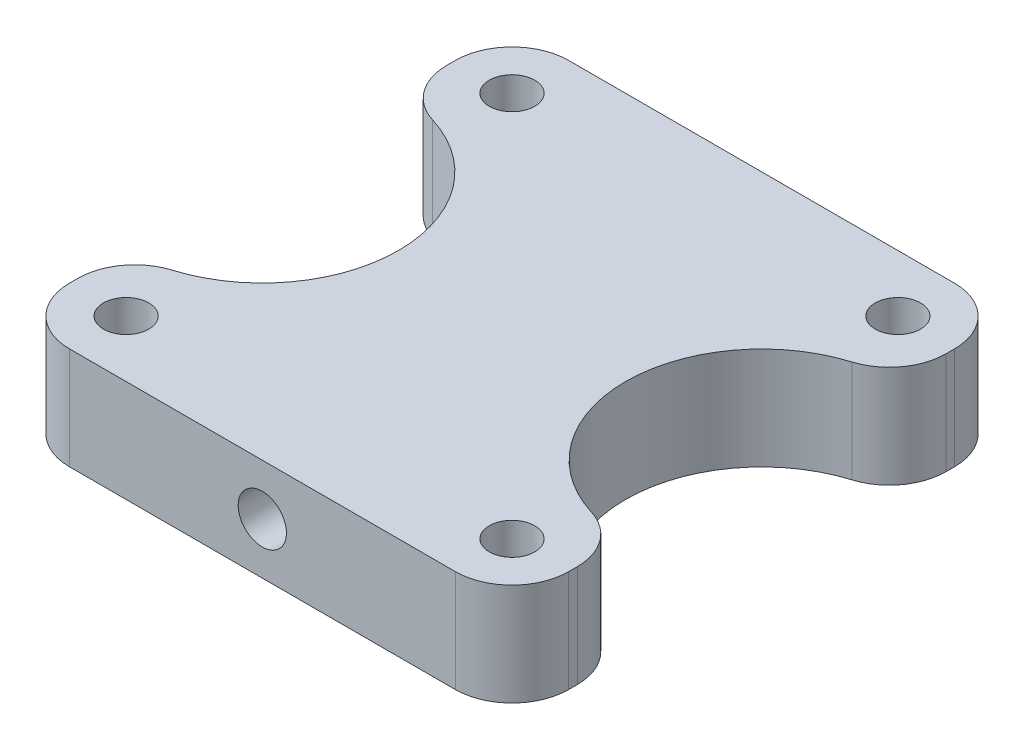
ISO-10303-21;
HEADER;
FILE_DESCRIPTION(('STEP AP214'),'2;1');
FILE_NAME('part.step','',(''),(''),'','','');
FILE_SCHEMA(('AUTOMOTIVE_DESIGN { 1 0 10303 214 1 1 1 1 }'));
ENDSEC;
DATA;
#1=APPLICATION_CONTEXT('core data for automotive mechanical design processes');
#2=APPLICATION_PROTOCOL_DEFINITION('international standard','automotive_design',2000,#1);
#3=PRODUCT_CONTEXT('',#1,'mechanical');
#4=PRODUCT('Part','Part','',(#3));
#5=PRODUCT_RELATED_PRODUCT_CATEGORY('part','',(#4));
#6=PRODUCT_DEFINITION_FORMATION('','',#4);
#7=PRODUCT_DEFINITION_CONTEXT('part definition',#1,'design');
#8=PRODUCT_DEFINITION('design','',#6,#7);
#9=PRODUCT_DEFINITION_SHAPE('','',#8);
#10=(LENGTH_UNIT() NAMED_UNIT(*) SI_UNIT(.MILLI.,.METRE.));
#11=(NAMED_UNIT(*) PLANE_ANGLE_UNIT() SI_UNIT($,.RADIAN.));
#12=(NAMED_UNIT(*) SI_UNIT($,.STERADIAN.) SOLID_ANGLE_UNIT());
#13=UNCERTAINTY_MEASURE_WITH_UNIT(LENGTH_MEASURE(1.E-05),#10,'distance_accuracy_value','');
#14=(GEOMETRIC_REPRESENTATION_CONTEXT(3) GLOBAL_UNCERTAINTY_ASSIGNED_CONTEXT((#13)) GLOBAL_UNIT_ASSIGNED_CONTEXT((#10,
#11,#12)) REPRESENTATION_CONTEXT('',''));
#15=CARTESIAN_POINT('',(0.,0.,0.));
#16=DIRECTION('',(0.,0.,1.));
#17=DIRECTION('',(1.,0.,0.));
#18=AXIS2_PLACEMENT_3D('',#15,#16,#17);
#19=CARTESIAN_POINT('',(-44.,18.,44.));
#20=DIRECTION('',(-1.,0.,0.));
#21=DIRECTION('',(0.,0.,1.));
#22=AXIS2_PLACEMENT_3D('',#19,#20,#21);
#23=PLANE('',#22);
#24=DIRECTION('',(0.,0.,-1.));
#25=VECTOR('',#24,1.);
#26=CARTESIAN_POINT('',(-44.,18.,44.));
#27=LINE('',#26,#25);
#28=CARTESIAN_POINT('',(-44.,18.,34.));
#29=VERTEX_POINT('',#28);
#30=CARTESIAN_POINT('',(-44.,18.,32.4961536185438));
#31=VERTEX_POINT('',#30);
#32=EDGE_CURVE('E182',#29,#31,#27,.T.);
#33=ORIENTED_EDGE('',*,*,#32,.T.);
#34=DIRECTION('',(0.,-1.,0.));
#35=VECTOR('',#34,1.);
#36=CARTESIAN_POINT('',(-44.,0.,32.4961536185438));
#37=LINE('',#36,#35);
#38=CARTESIAN_POINT('',(-44.,0.,32.4961536185438));
#39=VERTEX_POINT('',#38);
#40=EDGE_CURVE('E51',#31,#39,#37,.T.);
#41=ORIENTED_EDGE('',*,*,#40,.T.);
#42=DIRECTION('',(0.,0.,-1.));
#43=VECTOR('',#42,1.);
#44=CARTESIAN_POINT('',(-44.,0.,44.));
#45=LINE('',#44,#43);
#46=CARTESIAN_POINT('',(-44.,0.,34.));
#47=VERTEX_POINT('',#46);
#48=EDGE_CURVE('E160',#47,#39,#45,.T.);
#49=ORIENTED_EDGE('',*,*,#48,.F.);
#50=DIRECTION('',(0.,-1.,0.));
#51=VECTOR('',#50,1.);
#52=CARTESIAN_POINT('',(-44.,18.,34.));
#53=LINE('',#52,#51);
#54=EDGE_CURVE('E173',#47,#29,#53,.F.);
#55=ORIENTED_EDGE('',*,*,#54,.T.);
#56=EDGE_LOOP('',(#33,#41,#49,#55));
#57=FACE_BOUND('',#56,.T.);
#58=ADVANCED_FACE('F43',(#57),#23,.T.);
#59=CARTESIAN_POINT('',(44.,18.,44.));
#60=DIRECTION('',(-1.,0.,0.));
#61=DIRECTION('',(0.,0.,1.));
#62=AXIS2_PLACEMENT_3D('',#59,#60,#61);
#63=PLANE('',#62);
#64=DIRECTION('',(0.,0.,-1.));
#65=VECTOR('',#64,1.);
#66=CARTESIAN_POINT('',(44.,0.,44.));
#67=LINE('',#66,#65);
#68=CARTESIAN_POINT('',(44.,0.,34.));
#69=VERTEX_POINT('',#68);
#70=CARTESIAN_POINT('',(44.,0.,32.4961536185438));
#71=VERTEX_POINT('',#70);
#72=EDGE_CURVE('E343',#69,#71,#67,.T.);
#73=ORIENTED_EDGE('',*,*,#72,.T.);
#74=DIRECTION('',(0.,1.,0.));
#75=VECTOR('',#74,1.);
#76=CARTESIAN_POINT('',(44.,18.,32.4961536185438));
#77=LINE('',#76,#75);
#78=CARTESIAN_POINT('',(44.,18.,32.4961536185438));
#79=VERTEX_POINT('',#78);
#80=EDGE_CURVE('E264',#71,#79,#77,.T.);
#81=ORIENTED_EDGE('',*,*,#80,.T.);
#82=DIRECTION('',(0.,0.,-1.));
#83=VECTOR('',#82,1.);
#84=CARTESIAN_POINT('',(44.,18.,44.));
#85=LINE('',#84,#83);
#86=CARTESIAN_POINT('',(44.,18.,34.));
#87=VERTEX_POINT('',#86);
#88=EDGE_CURVE('E334',#87,#79,#85,.T.);
#89=ORIENTED_EDGE('',*,*,#88,.F.);
#90=DIRECTION('',(0.,-1.,0.));
#91=VECTOR('',#90,1.);
#92=CARTESIAN_POINT('',(44.,18.,34.));
#93=LINE('',#92,#91);
#94=EDGE_CURVE('E209',#87,#69,#93,.T.);
#95=ORIENTED_EDGE('',*,*,#94,.T.);
#96=EDGE_LOOP('',(#73,#81,#89,#95));
#97=FACE_BOUND('',#96,.T.);
#98=ADVANCED_FACE('F378',(#97),#63,.F.);
#99=CARTESIAN_POINT('',(-34.,0.,-34.));
#100=DIRECTION('',(0.,1.,0.));
#101=DIRECTION('',(0.,0.,1.));
#102=AXIS2_PLACEMENT_3D('',#99,#100,#101);
#103=CYLINDRICAL_SURFACE('',#102,2.15);
#104=CARTESIAN_POINT('',(-34.,0.,-34.));
#105=DIRECTION('',(0.,1.,0.));
#106=DIRECTION('',(0.,0.,1.));
#107=AXIS2_PLACEMENT_3D('',#104,#105,#106);
#108=CIRCLE('',#107,2.15);
#109=CARTESIAN_POINT('',(-34.,0.,-31.85));
#110=VERTEX_POINT('',#109);
#111=EDGE_CURVE('E322',#110,#110,#108,.T.);
#112=ORIENTED_EDGE('',*,*,#111,.F.);
#113=EDGE_LOOP('',(#112));
#114=FACE_BOUND('',#113,.T.);
#115=CARTESIAN_POINT('',(-34.,5.,-34.));
#116=DIRECTION('',(0.,1.,0.));
#117=DIRECTION('',(0.,0.,1.));
#118=AXIS2_PLACEMENT_3D('',#115,#116,#117);
#119=CIRCLE('',#118,2.15);
#120=CARTESIAN_POINT('',(-34.,5.,-31.85));
#121=VERTEX_POINT('',#120);
#122=EDGE_CURVE('E230',#121,#121,#119,.F.);
#123=ORIENTED_EDGE('',*,*,#122,.F.);
#124=EDGE_LOOP('',(#123));
#125=FACE_BOUND('',#124,.T.);
#126=ADVANCED_FACE('F397',(#114,#125),#103,.F.);
#127=CARTESIAN_POINT('',(34.,0.,-34.));
#128=DIRECTION('',(0.,1.,0.));
#129=DIRECTION('',(0.,0.,1.));
#130=AXIS2_PLACEMENT_3D('',#127,#128,#129);
#131=CYLINDRICAL_SURFACE('',#130,2.15);
#132=CARTESIAN_POINT('',(34.,0.,-34.));
#133=DIRECTION('',(0.,1.,0.));
#134=DIRECTION('',(0.,0.,1.));
#135=AXIS2_PLACEMENT_3D('',#132,#133,#134);
#136=CIRCLE('',#135,2.15);
#137=CARTESIAN_POINT('',(34.,0.,-31.85));
#138=VERTEX_POINT('',#137);
#139=EDGE_CURVE('E319',#138,#138,#136,.T.);
#140=ORIENTED_EDGE('',*,*,#139,.F.);
#141=EDGE_LOOP('',(#140));
#142=FACE_BOUND('',#141,.T.);
#143=CARTESIAN_POINT('',(34.,5.,-34.));
#144=DIRECTION('',(0.,1.,0.));
#145=DIRECTION('',(0.,0.,1.));
#146=AXIS2_PLACEMENT_3D('',#143,#144,#145);
#147=CIRCLE('',#146,2.15);
#148=CARTESIAN_POINT('',(34.,5.,-31.85));
#149=VERTEX_POINT('',#148);
#150=EDGE_CURVE('E227',#149,#149,#147,.F.);
#151=ORIENTED_EDGE('',*,*,#150,.F.);
#152=EDGE_LOOP('',(#151));
#153=FACE_BOUND('',#152,.T.);
#154=ADVANCED_FACE('F483',(#142,#153),#131,.F.);
#155=CARTESIAN_POINT('',(34.,0.,34.));
#156=DIRECTION('',(0.,1.,0.));
#157=DIRECTION('',(0.,0.,1.));
#158=AXIS2_PLACEMENT_3D('',#155,#156,#157);
#159=CYLINDRICAL_SURFACE('',#158,2.15);
#160=CARTESIAN_POINT('',(34.,0.,34.));
#161=DIRECTION('',(0.,1.,0.));
#162=DIRECTION('',(0.,0.,1.));
#163=AXIS2_PLACEMENT_3D('',#160,#161,#162);
#164=CIRCLE('',#163,2.15);
#165=CARTESIAN_POINT('',(34.,0.,36.15));
#166=VERTEX_POINT('',#165);
#167=EDGE_CURVE('E323',#166,#166,#164,.T.);
#168=ORIENTED_EDGE('',*,*,#167,.F.);
#169=EDGE_LOOP('',(#168));
#170=FACE_BOUND('',#169,.T.);
#171=CARTESIAN_POINT('',(34.,5.,34.));
#172=DIRECTION('',(0.,1.,0.));
#173=DIRECTION('',(0.,0.,1.));
#174=AXIS2_PLACEMENT_3D('',#171,#172,#173);
#175=CIRCLE('',#174,2.15);
#176=CARTESIAN_POINT('',(34.,5.,36.15));
#177=VERTEX_POINT('',#176);
#178=EDGE_CURVE('E223',#177,#177,#175,.F.);
#179=ORIENTED_EDGE('',*,*,#178,.F.);
#180=EDGE_LOOP('',(#179));
#181=FACE_BOUND('',#180,.T.);
#182=ADVANCED_FACE('F413',(#170,#181),#159,.F.);
#183=CARTESIAN_POINT('',(-34.,0.,34.));
#184=DIRECTION('',(0.,1.,0.));
#185=DIRECTION('',(0.,0.,1.));
#186=AXIS2_PLACEMENT_3D('',#183,#184,#185);
#187=CYLINDRICAL_SURFACE('',#186,2.15);
#188=CARTESIAN_POINT('',(-34.,0.,34.));
#189=DIRECTION('',(0.,1.,0.));
#190=DIRECTION('',(0.,0.,1.));
#191=AXIS2_PLACEMENT_3D('',#188,#189,#190);
#192=CIRCLE('',#191,2.15);
#193=CARTESIAN_POINT('',(-34.,0.,36.15));
#194=VERTEX_POINT('',#193);
#195=EDGE_CURVE('E233',#194,#194,#192,.T.);
#196=ORIENTED_EDGE('',*,*,#195,.F.);
#197=EDGE_LOOP('',(#196));
#198=FACE_BOUND('',#197,.T.);
#199=CARTESIAN_POINT('',(-34.,5.,34.));
#200=DIRECTION('',(0.,1.,0.));
#201=DIRECTION('',(0.,0.,1.));
#202=AXIS2_PLACEMENT_3D('',#199,#200,#201);
#203=CIRCLE('',#202,2.15);
#204=CARTESIAN_POINT('',(-34.,5.,36.15));
#205=VERTEX_POINT('',#204);
#206=EDGE_CURVE('E220',#205,#205,#203,.F.);
#207=ORIENTED_EDGE('',*,*,#206,.F.);
#208=EDGE_LOOP('',(#207));
#209=FACE_BOUND('',#208,.T.);
#210=ADVANCED_FACE('F408',(#198,#209),#187,.F.);
#211=CARTESIAN_POINT('',(-44.,18.,-44.));
#212=DIRECTION('',(0.,0.,-1.));
#213=DIRECTION('',(-1.,0.,0.));
#214=AXIS2_PLACEMENT_3D('',#211,#212,#213);
#215=PLANE('',#214);
#216=DIRECTION('',(1.,0.,0.));
#217=VECTOR('',#216,1.);
#218=CARTESIAN_POINT('',(-44.,0.,-44.));
#219=LINE('',#218,#217);
#220=CARTESIAN_POINT('',(-34.,0.,-44.));
#221=VERTEX_POINT('',#220);
#222=CARTESIAN_POINT('',(34.,0.,-44.));
#223=VERTEX_POINT('',#222);
#224=EDGE_CURVE('E330',#221,#223,#219,.T.);
#225=ORIENTED_EDGE('',*,*,#224,.F.);
#226=DIRECTION('',(0.,-1.,0.));
#227=VECTOR('',#226,1.);
#228=CARTESIAN_POINT('',(-34.,18.,-44.));
#229=LINE('',#228,#227);
#230=CARTESIAN_POINT('',(-34.,18.,-44.));
#231=VERTEX_POINT('',#230);
#232=EDGE_CURVE('E199',#221,#231,#229,.F.);
#233=ORIENTED_EDGE('',*,*,#232,.T.);
#234=DIRECTION('',(1.,0.,0.));
#235=VECTOR('',#234,1.);
#236=CARTESIAN_POINT('',(-44.,18.,-44.));
#237=LINE('',#236,#235);
#238=CARTESIAN_POINT('',(34.,18.,-44.));
#239=VERTEX_POINT('',#238);
#240=EDGE_CURVE('E176',#231,#239,#237,.T.);
#241=ORIENTED_EDGE('',*,*,#240,.T.);
#242=DIRECTION('',(0.,-1.,0.));
#243=VECTOR('',#242,1.);
#244=CARTESIAN_POINT('',(34.,0.,-44.));
#245=LINE('',#244,#243);
#246=EDGE_CURVE('E196',#239,#223,#245,.T.);
#247=ORIENTED_EDGE('',*,*,#246,.T.);
#248=EDGE_LOOP('',(#225,#233,#241,#247));
#249=FACE_BOUND('',#248,.T.);
#250=ADVANCED_FACE('F359',(#249),#215,.T.);
#251=CARTESIAN_POINT('',(-44.,0.,-32.4961536185438));
#252=VERTEX_POINT('',#251);
#253=CARTESIAN_POINT('',(-44.,0.,-34.));
#254=VERTEX_POINT('',#253);
#255=EDGE_CURVE('E177',#252,#254,#45,.T.);
#256=ORIENTED_EDGE('',*,*,#255,.F.);
#257=DIRECTION('',(0.,-1.,0.));
#258=VECTOR('',#257,1.);
#259=CARTESIAN_POINT('',(-44.,18.,-32.4961536185438));
#260=LINE('',#259,#258);
#261=CARTESIAN_POINT('',(-44.,18.,-32.4961536185438));
#262=VERTEX_POINT('',#261);
#263=EDGE_CURVE('E12',#252,#262,#260,.F.);
#264=ORIENTED_EDGE('',*,*,#263,.T.);
#265=CARTESIAN_POINT('',(-44.,18.,-34.));
#266=VERTEX_POINT('',#265);
#267=EDGE_CURVE('E186',#262,#266,#27,.T.);
#268=ORIENTED_EDGE('',*,*,#267,.T.);
#269=DIRECTION('',(0.,-1.,0.));
#270=VECTOR('',#269,1.);
#271=CARTESIAN_POINT('',(-44.,18.,-34.));
#272=LINE('',#271,#270);
#273=EDGE_CURVE('E169',#266,#254,#272,.T.);
#274=ORIENTED_EDGE('',*,*,#273,.T.);
#275=EDGE_LOOP('',(#256,#264,#268,#274));
#276=FACE_BOUND('',#275,.T.);
#277=ADVANCED_FACE('F354',(#276),#23,.T.);
#278=CARTESIAN_POINT('',(-44.,18.,44.));
#279=DIRECTION('',(0.,0.,-1.));
#280=DIRECTION('',(-1.,0.,0.));
#281=AXIS2_PLACEMENT_3D('',#278,#279,#280);
#282=PLANE('',#281);
#283=CARTESIAN_POINT('',(0.,9.,44.));
#284=DIRECTION('',(0.,0.,1.));
#285=DIRECTION('',(1.,0.,0.));
#286=AXIS2_PLACEMENT_3D('',#283,#284,#285);
#287=CIRCLE('',#286,4.25);
#288=CARTESIAN_POINT('',(4.25,9.,44.));
#289=VERTEX_POINT('',#288);
#290=EDGE_CURVE('E289',#289,#289,#287,.T.);
#291=ORIENTED_EDGE('',*,*,#290,.F.);
#292=EDGE_LOOP('',(#291));
#293=FACE_BOUND('',#292,.T.);
#294=DIRECTION('',(1.,0.,0.));
#295=VECTOR('',#294,1.);
#296=CARTESIAN_POINT('',(-44.,0.,44.));
#297=LINE('',#296,#295);
#298=CARTESIAN_POINT('',(-34.,0.,44.));
#299=VERTEX_POINT('',#298);
#300=CARTESIAN_POINT('',(34.,0.,44.));
#301=VERTEX_POINT('',#300);
#302=EDGE_CURVE('E163',#299,#301,#297,.T.);
#303=ORIENTED_EDGE('',*,*,#302,.T.);
#304=DIRECTION('',(0.,-1.,0.));
#305=VECTOR('',#304,1.);
#306=CARTESIAN_POINT('',(34.,18.,44.));
#307=LINE('',#306,#305);
#308=CARTESIAN_POINT('',(34.,18.,44.));
#309=VERTEX_POINT('',#308);
#310=EDGE_CURVE('E217',#301,#309,#307,.F.);
#311=ORIENTED_EDGE('',*,*,#310,.T.);
#312=DIRECTION('',(1.,0.,0.));
#313=VECTOR('',#312,1.);
#314=CARTESIAN_POINT('',(-44.,18.,44.));
#315=LINE('',#314,#313);
#316=CARTESIAN_POINT('',(-34.,18.,44.));
#317=VERTEX_POINT('',#316);
#318=EDGE_CURVE('E337',#317,#309,#315,.T.);
#319=ORIENTED_EDGE('',*,*,#318,.F.);
#320=DIRECTION('',(0.,-1.,0.));
#321=VECTOR('',#320,1.);
#322=CARTESIAN_POINT('',(-34.,0.,44.));
#323=LINE('',#322,#321);
#324=EDGE_CURVE('E215',#317,#299,#323,.T.);
#325=ORIENTED_EDGE('',*,*,#324,.T.);
#326=EDGE_LOOP('',(#303,#311,#319,#325));
#327=FACE_BOUND('',#326,.T.);
#328=ADVANCED_FACE('F402',(#293,#327),#282,.F.);
#329=CARTESIAN_POINT('',(44.,18.,-32.4961536185438));
#330=VERTEX_POINT('',#329);
#331=CARTESIAN_POINT('',(44.,18.,-34.));
#332=VERTEX_POINT('',#331);
#333=EDGE_CURVE('E333',#330,#332,#85,.T.);
#334=ORIENTED_EDGE('',*,*,#333,.F.);
#335=DIRECTION('',(0.,1.,0.));
#336=VECTOR('',#335,1.);
#337=CARTESIAN_POINT('',(44.,18.,-32.4961536185438));
#338=LINE('',#337,#336);
#339=CARTESIAN_POINT('',(44.,0.,-32.4961536185438));
#340=VERTEX_POINT('',#339);
#341=EDGE_CURVE('E242',#330,#340,#338,.F.);
#342=ORIENTED_EDGE('',*,*,#341,.T.);
#343=CARTESIAN_POINT('',(44.,0.,-34.));
#344=VERTEX_POINT('',#343);
#345=EDGE_CURVE('E342',#340,#344,#67,.T.);
#346=ORIENTED_EDGE('',*,*,#345,.T.);
#347=DIRECTION('',(0.,-1.,0.));
#348=VECTOR('',#347,1.);
#349=CARTESIAN_POINT('',(44.,18.,-34.));
#350=LINE('',#349,#348);
#351=EDGE_CURVE('E212',#344,#332,#350,.F.);
#352=ORIENTED_EDGE('',*,*,#351,.T.);
#353=EDGE_LOOP('',(#334,#342,#346,#352));
#354=FACE_BOUND('',#353,.T.);
#355=ADVANCED_FACE('F366',(#354),#63,.F.);
#356=CARTESIAN_POINT('',(0.,18.,0.));
#357=DIRECTION('',(0.,1.,0.));
#358=DIRECTION('',(0.,0.,1.));
#359=AXIS2_PLACEMENT_3D('',#356,#357,#358);
#360=PLANE('',#359);
#361=CARTESIAN_POINT('',(44.,18.,0.));
#362=DIRECTION('',(0.,1.,0.));
#363=DIRECTION('',(0.,0.,1.));
#364=AXIS2_PLACEMENT_3D('',#361,#362,#363);
#365=CIRCLE('',#364,24.);
#366=CARTESIAN_POINT('',(36.9411764705882,18.,-22.9384613777956));
#367=VERTEX_POINT('',#366);
#368=CARTESIAN_POINT('',(36.9411764705882,18.,22.9384613777957));
#369=VERTEX_POINT('',#368);
#370=EDGE_CURVE('E287',#367,#369,#365,.T.);
#371=ORIENTED_EDGE('',*,*,#370,.F.);
#372=CARTESIAN_POINT('',(34.,18.,-32.4961536185438));
#373=DIRECTION('',(0.,1.,0.));
#374=DIRECTION('',(0.,0.,1.));
#375=AXIS2_PLACEMENT_3D('',#372,#373,#374);
#376=CIRCLE('',#375,10.);
#377=EDGE_CURVE('E262',#367,#330,#376,.T.);
#378=ORIENTED_EDGE('',*,*,#377,.T.);
#379=ORIENTED_EDGE('',*,*,#333,.T.);
#380=CARTESIAN_POINT('',(34.,18.,-34.));
#381=DIRECTION('',(0.,1.,0.));
#382=DIRECTION('',(0.,0.,1.));
#383=AXIS2_PLACEMENT_3D('',#380,#381,#382);
#384=CIRCLE('',#383,10.);
#385=EDGE_CURVE('E204',#332,#239,#384,.T.);
#386=ORIENTED_EDGE('',*,*,#385,.T.);
#387=ORIENTED_EDGE('',*,*,#240,.F.);
#388=CARTESIAN_POINT('',(-34.,18.,-34.));
#389=DIRECTION('',(0.,1.,0.));
#390=DIRECTION('',(0.,0.,1.));
#391=AXIS2_PLACEMENT_3D('',#388,#389,#390);
#392=CIRCLE('',#391,10.);
#393=EDGE_CURVE('E206',#231,#266,#392,.T.);
#394=ORIENTED_EDGE('',*,*,#393,.T.);
#395=ORIENTED_EDGE('',*,*,#267,.F.);
#396=CARTESIAN_POINT('',(-34.,18.,-32.4961536185438));
#397=DIRECTION('',(0.,1.,0.));
#398=DIRECTION('',(0.,0.,1.));
#399=AXIS2_PLACEMENT_3D('',#396,#397,#398);
#400=CIRCLE('',#399,10.);
#401=CARTESIAN_POINT('',(-36.9411764705882,18.,-22.9384613777956));
#402=VERTEX_POINT('',#401);
#403=EDGE_CURVE('E257',#262,#402,#400,.T.);
#404=ORIENTED_EDGE('',*,*,#403,.T.);
#405=CARTESIAN_POINT('',(-44.,18.,0.));
#406=DIRECTION('',(0.,1.,0.));
#407=DIRECTION('',(0.,0.,1.));
#408=AXIS2_PLACEMENT_3D('',#405,#406,#407);
#409=CIRCLE('',#408,24.);
#410=CARTESIAN_POINT('',(-36.9411764705882,18.,22.9384613777957));
#411=VERTEX_POINT('',#410);
#412=EDGE_CURVE('E277',#411,#402,#409,.T.);
#413=ORIENTED_EDGE('',*,*,#412,.F.);
#414=CARTESIAN_POINT('',(-34.,18.,32.4961536185438));
#415=DIRECTION('',(0.,1.,0.));
#416=DIRECTION('',(0.,0.,1.));
#417=AXIS2_PLACEMENT_3D('',#414,#415,#416);
#418=CIRCLE('',#417,10.);
#419=EDGE_CURVE('E259',#411,#31,#418,.T.);
#420=ORIENTED_EDGE('',*,*,#419,.T.);
#421=ORIENTED_EDGE('',*,*,#32,.F.);
#422=CARTESIAN_POINT('',(-34.,18.,34.));
#423=DIRECTION('',(0.,1.,0.));
#424=DIRECTION('',(0.,0.,1.));
#425=AXIS2_PLACEMENT_3D('',#422,#423,#424);
#426=CIRCLE('',#425,10.);
#427=EDGE_CURVE('E181',#29,#317,#426,.T.);
#428=ORIENTED_EDGE('',*,*,#427,.T.);
#429=ORIENTED_EDGE('',*,*,#318,.T.);
#430=CARTESIAN_POINT('',(34.,18.,34.));
#431=DIRECTION('',(0.,1.,0.));
#432=DIRECTION('',(0.,0.,1.));
#433=AXIS2_PLACEMENT_3D('',#430,#431,#432);
#434=CIRCLE('',#433,10.);
#435=EDGE_CURVE('E202',#309,#87,#434,.T.);
#436=ORIENTED_EDGE('',*,*,#435,.T.);
#437=ORIENTED_EDGE('',*,*,#88,.T.);
#438=CARTESIAN_POINT('',(34.,18.,32.4961536185438));
#439=DIRECTION('',(0.,1.,0.));
#440=DIRECTION('',(0.,0.,1.));
#441=AXIS2_PLACEMENT_3D('',#438,#439,#440);
#442=CIRCLE('',#441,10.);
#443=EDGE_CURVE('E64',#79,#369,#442,.T.);
#444=ORIENTED_EDGE('',*,*,#443,.T.);
#445=EDGE_LOOP('',(#371,#378,#379,#386,#387,#394,#395,#404,#413,#420,#421,#428,#429,#436,#437,#444));
#446=FACE_BOUND('',#445,.T.);
#447=CARTESIAN_POINT('',(-34.,18.,34.));
#448=DIRECTION('',(0.,1.,0.));
#449=DIRECTION('',(0.,0.,1.));
#450=AXIS2_PLACEMENT_3D('',#447,#448,#449);
#451=CIRCLE('',#450,4.);
#452=CARTESIAN_POINT('',(-34.,18.,38.));
#453=VERTEX_POINT('',#452);
#454=EDGE_CURVE('E308',#453,#453,#451,.T.);
#455=ORIENTED_EDGE('',*,*,#454,.F.);
#456=EDGE_LOOP('',(#455));
#457=FACE_BOUND('',#456,.T.);
#458=CARTESIAN_POINT('',(34.,18.,34.));
#459=DIRECTION('',(0.,1.,0.));
#460=DIRECTION('',(0.,0.,1.));
#461=AXIS2_PLACEMENT_3D('',#458,#459,#460);
#462=CIRCLE('',#461,4.);
#463=CARTESIAN_POINT('',(34.,18.,38.));
#464=VERTEX_POINT('',#463);
#465=EDGE_CURVE('E301',#464,#464,#462,.T.);
#466=ORIENTED_EDGE('',*,*,#465,.F.);
#467=EDGE_LOOP('',(#466));
#468=FACE_BOUND('',#467,.T.);
#469=CARTESIAN_POINT('',(34.,18.,-34.));
#470=DIRECTION('',(0.,1.,0.));
#471=DIRECTION('',(0.,0.,1.));
#472=AXIS2_PLACEMENT_3D('',#469,#470,#471);
#473=CIRCLE('',#472,4.00000000000001);
#474=CARTESIAN_POINT('',(34.,18.,-30.));
#475=VERTEX_POINT('',#474);
#476=EDGE_CURVE('E300',#475,#475,#473,.T.);
#477=ORIENTED_EDGE('',*,*,#476,.F.);
#478=EDGE_LOOP('',(#477));
#479=FACE_BOUND('',#478,.T.);
#480=CARTESIAN_POINT('',(-34.,18.,-34.));
#481=DIRECTION('',(0.,1.,0.));
#482=DIRECTION('',(0.,0.,1.));
#483=AXIS2_PLACEMENT_3D('',#480,#481,#482);
#484=CIRCLE('',#483,4.);
#485=CARTESIAN_POINT('',(-34.,18.,-30.));
#486=VERTEX_POINT('',#485);
#487=EDGE_CURVE('E304',#486,#486,#484,.T.);
#488=ORIENTED_EDGE('',*,*,#487,.F.);
#489=EDGE_LOOP('',(#488));
#490=FACE_BOUND('',#489,.T.);
#491=ADVANCED_FACE('F284',(#446,#457,#468,#479,#490),#360,.T.);
#492=CARTESIAN_POINT('',(0.,0.,0.));
#493=DIRECTION('',(0.,1.,0.));
#494=DIRECTION('',(0.,0.,1.));
#495=AXIS2_PLACEMENT_3D('',#492,#493,#494);
#496=PLANE('',#495);
#497=ORIENTED_EDGE('',*,*,#195,.T.);
#498=EDGE_LOOP('',(#497));
#499=FACE_BOUND('',#498,.T.);
#500=ORIENTED_EDGE('',*,*,#167,.T.);
#501=EDGE_LOOP('',(#500));
#502=FACE_BOUND('',#501,.T.);
#503=ORIENTED_EDGE('',*,*,#139,.T.);
#504=EDGE_LOOP('',(#503));
#505=FACE_BOUND('',#504,.T.);
#506=ORIENTED_EDGE('',*,*,#111,.T.);
#507=EDGE_LOOP('',(#506));
#508=FACE_BOUND('',#507,.T.);
#509=ORIENTED_EDGE('',*,*,#345,.F.);
#510=CARTESIAN_POINT('',(34.,0.,-32.4961536185438));
#511=DIRECTION('',(0.,1.,0.));
#512=DIRECTION('',(0.,0.,1.));
#513=AXIS2_PLACEMENT_3D('',#510,#511,#512);
#514=CIRCLE('',#513,10.);
#515=CARTESIAN_POINT('',(36.9411764705882,0.,-22.9384613777956));
#516=VERTEX_POINT('',#515);
#517=EDGE_CURVE('E251',#340,#516,#514,.F.);
#518=ORIENTED_EDGE('',*,*,#517,.T.);
#519=CARTESIAN_POINT('',(44.,0.,0.));
#520=DIRECTION('',(0.,1.,0.));
#521=DIRECTION('',(0.,0.,1.));
#522=AXIS2_PLACEMENT_3D('',#519,#520,#521);
#523=CIRCLE('',#522,24.);
#524=CARTESIAN_POINT('',(36.9411764705882,0.,22.9384613777957));
#525=VERTEX_POINT('',#524);
#526=EDGE_CURVE('E239',#516,#525,#523,.T.);
#527=ORIENTED_EDGE('',*,*,#526,.T.);
#528=CARTESIAN_POINT('',(34.,0.,32.4961536185438));
#529=DIRECTION('',(0.,1.,0.));
#530=DIRECTION('',(0.,0.,1.));
#531=AXIS2_PLACEMENT_3D('',#528,#529,#530);
#532=CIRCLE('',#531,10.);
#533=EDGE_CURVE('E249',#525,#71,#532,.F.);
#534=ORIENTED_EDGE('',*,*,#533,.T.);
#535=ORIENTED_EDGE('',*,*,#72,.F.);
#536=CARTESIAN_POINT('',(34.,0.,34.));
#537=DIRECTION('',(0.,1.,0.));
#538=DIRECTION('',(0.,0.,1.));
#539=AXIS2_PLACEMENT_3D('',#536,#537,#538);
#540=CIRCLE('',#539,10.);
#541=EDGE_CURVE('E168',#69,#301,#540,.F.);
#542=ORIENTED_EDGE('',*,*,#541,.T.);
#543=ORIENTED_EDGE('',*,*,#302,.F.);
#544=CARTESIAN_POINT('',(-34.,0.,34.));
#545=DIRECTION('',(0.,1.,0.));
#546=DIRECTION('',(0.,0.,1.));
#547=AXIS2_PLACEMENT_3D('',#544,#545,#546);
#548=CIRCLE('',#547,10.);
#549=EDGE_CURVE('E156',#299,#47,#548,.F.);
#550=ORIENTED_EDGE('',*,*,#549,.T.);
#551=ORIENTED_EDGE('',*,*,#48,.T.);
#552=CARTESIAN_POINT('',(-34.,0.,32.4961536185438));
#553=DIRECTION('',(0.,1.,0.));
#554=DIRECTION('',(0.,0.,1.));
#555=AXIS2_PLACEMENT_3D('',#552,#553,#554);
#556=CIRCLE('',#555,10.);
#557=CARTESIAN_POINT('',(-36.9411764705882,0.,22.9384613777957));
#558=VERTEX_POINT('',#557);
#559=EDGE_CURVE('E247',#39,#558,#556,.F.);
#560=ORIENTED_EDGE('',*,*,#559,.T.);
#561=CARTESIAN_POINT('',(-44.,0.,0.));
#562=DIRECTION('',(0.,1.,0.));
#563=DIRECTION('',(0.,0.,1.));
#564=AXIS2_PLACEMENT_3D('',#561,#562,#563);
#565=CIRCLE('',#564,24.);
#566=CARTESIAN_POINT('',(-36.9411764705882,0.,-22.9384613777956));
#567=VERTEX_POINT('',#566);
#568=EDGE_CURVE('E280',#558,#567,#565,.T.);
#569=ORIENTED_EDGE('',*,*,#568,.T.);
#570=CARTESIAN_POINT('',(-34.,0.,-32.4961536185438));
#571=DIRECTION('',(0.,1.,0.));
#572=DIRECTION('',(0.,0.,1.));
#573=AXIS2_PLACEMENT_3D('',#570,#571,#572);
#574=CIRCLE('',#573,10.);
#575=EDGE_CURVE('E245',#567,#252,#574,.F.);
#576=ORIENTED_EDGE('',*,*,#575,.T.);
#577=ORIENTED_EDGE('',*,*,#255,.T.);
#578=CARTESIAN_POINT('',(-34.,0.,-34.));
#579=DIRECTION('',(0.,1.,0.));
#580=DIRECTION('',(0.,0.,1.));
#581=AXIS2_PLACEMENT_3D('',#578,#579,#580);
#582=CIRCLE('',#581,10.);
#583=EDGE_CURVE('E194',#254,#221,#582,.F.);
#584=ORIENTED_EDGE('',*,*,#583,.T.);
#585=ORIENTED_EDGE('',*,*,#224,.T.);
#586=CARTESIAN_POINT('',(34.,0.,-34.));
#587=DIRECTION('',(0.,1.,0.));
#588=DIRECTION('',(0.,0.,1.));
#589=AXIS2_PLACEMENT_3D('',#586,#587,#588);
#590=CIRCLE('',#589,10.);
#591=EDGE_CURVE('E191',#223,#344,#590,.F.);
#592=ORIENTED_EDGE('',*,*,#591,.T.);
#593=EDGE_LOOP('',(#509,#518,#527,#534,#535,#542,#543,#550,#551,#560,#569,#576,#577,#584,#585,#592));
#594=FACE_BOUND('',#593,.T.);
#595=ADVANCED_FACE('F159',(#499,#502,#505,#508,#594),#496,.F.);
#596=CARTESIAN_POINT('',(-34.,18.,-34.));
#597=DIRECTION('',(0.,-1.,0.));
#598=DIRECTION('',(0.,0.,-1.));
#599=AXIS2_PLACEMENT_3D('',#596,#597,#598);
#600=CYLINDRICAL_SURFACE('',#599,10.);
#601=ORIENTED_EDGE('',*,*,#393,.F.);
#602=ORIENTED_EDGE('',*,*,#232,.F.);
#603=ORIENTED_EDGE('',*,*,#583,.F.);
#604=ORIENTED_EDGE('',*,*,#273,.F.);
#605=EDGE_LOOP('',(#601,#602,#603,#604));
#606=FACE_BOUND('',#605,.T.);
#607=ADVANCED_FACE('F353',(#606),#600,.T.);
#608=CARTESIAN_POINT('',(34.,18.,-34.));
#609=DIRECTION('',(0.,1.,0.));
#610=DIRECTION('',(0.,0.,1.));
#611=AXIS2_PLACEMENT_3D('',#608,#609,#610);
#612=CYLINDRICAL_SURFACE('',#611,10.);
#613=ORIENTED_EDGE('',*,*,#385,.F.);
#614=ORIENTED_EDGE('',*,*,#351,.F.);
#615=ORIENTED_EDGE('',*,*,#591,.F.);
#616=ORIENTED_EDGE('',*,*,#246,.F.);
#617=EDGE_LOOP('',(#613,#614,#615,#616));
#618=FACE_BOUND('',#617,.T.);
#619=ADVANCED_FACE('F361',(#618),#612,.T.);
#620=CARTESIAN_POINT('',(34.,18.,34.));
#621=DIRECTION('',(0.,-1.,0.));
#622=DIRECTION('',(0.,0.,-1.));
#623=AXIS2_PLACEMENT_3D('',#620,#621,#622);
#624=CYLINDRICAL_SURFACE('',#623,10.);
#625=ORIENTED_EDGE('',*,*,#435,.F.);
#626=ORIENTED_EDGE('',*,*,#310,.F.);
#627=ORIENTED_EDGE('',*,*,#541,.F.);
#628=ORIENTED_EDGE('',*,*,#94,.F.);
#629=EDGE_LOOP('',(#625,#626,#627,#628));
#630=FACE_BOUND('',#629,.T.);
#631=ADVANCED_FACE('F381',(#630),#624,.T.);
#632=CARTESIAN_POINT('',(-34.,18.,34.));
#633=DIRECTION('',(0.,1.,0.));
#634=DIRECTION('',(0.,0.,1.));
#635=AXIS2_PLACEMENT_3D('',#632,#633,#634);
#636=CYLINDRICAL_SURFACE('',#635,10.);
#637=ORIENTED_EDGE('',*,*,#427,.F.);
#638=ORIENTED_EDGE('',*,*,#54,.F.);
#639=ORIENTED_EDGE('',*,*,#549,.F.);
#640=ORIENTED_EDGE('',*,*,#324,.F.);
#641=EDGE_LOOP('',(#637,#638,#639,#640));
#642=FACE_BOUND('',#641,.T.);
#643=ADVANCED_FACE('F180',(#642),#636,.T.);
#644=CARTESIAN_POINT('',(0.,5.,0.));
#645=DIRECTION('',(0.,1.,0.));
#646=DIRECTION('',(0.,0.,1.));
#647=AXIS2_PLACEMENT_3D('',#644,#645,#646);
#648=PLANE('',#647);
#649=CARTESIAN_POINT('',(-34.,5.,34.));
#650=DIRECTION('',(0.,1.,0.));
#651=DIRECTION('',(0.,0.,1.));
#652=AXIS2_PLACEMENT_3D('',#649,#650,#651);
#653=CIRCLE('',#652,4.);
#654=CARTESIAN_POINT('',(-34.,5.,38.));
#655=VERTEX_POINT('',#654);
#656=EDGE_CURVE('E296',#655,#655,#653,.F.);
#657=ORIENTED_EDGE('',*,*,#656,.F.);
#658=EDGE_LOOP('',(#657));
#659=FACE_BOUND('',#658,.T.);
#660=ORIENTED_EDGE('',*,*,#206,.T.);
#661=EDGE_LOOP('',(#660));
#662=FACE_BOUND('',#661,.T.);
#663=ADVANCED_FACE('F425',(#659,#662),#648,.T.);
#664=CARTESIAN_POINT('',(-34.,-11.3137084989848,34.));
#665=DIRECTION('',(0.,1.,0.));
#666=DIRECTION('',(0.,0.,1.));
#667=AXIS2_PLACEMENT_3D('',#664,#665,#666);
#668=CYLINDRICAL_SURFACE('',#667,4.);
#669=ORIENTED_EDGE('',*,*,#656,.T.);
#670=EDGE_LOOP('',(#669));
#671=FACE_BOUND('',#670,.T.);
#672=ORIENTED_EDGE('',*,*,#454,.T.);
#673=EDGE_LOOP('',(#672));
#674=FACE_BOUND('',#673,.T.);
#675=ADVANCED_FACE('F472',(#671,#674),#668,.F.);
#676=CARTESIAN_POINT('',(0.,5.,0.));
#677=DIRECTION('',(0.,1.,0.));
#678=DIRECTION('',(0.,0.,1.));
#679=AXIS2_PLACEMENT_3D('',#676,#677,#678);
#680=PLANE('',#679);
#681=CARTESIAN_POINT('',(34.,5.,34.));
#682=DIRECTION('',(0.,1.,0.));
#683=DIRECTION('',(0.,0.,1.));
#684=AXIS2_PLACEMENT_3D('',#681,#682,#683);
#685=CIRCLE('',#684,4.);
#686=CARTESIAN_POINT('',(34.,5.,38.));
#687=VERTEX_POINT('',#686);
#688=EDGE_CURVE('E305',#687,#687,#685,.F.);
#689=ORIENTED_EDGE('',*,*,#688,.F.);
#690=EDGE_LOOP('',(#689));
#691=FACE_BOUND('',#690,.T.);
#692=ORIENTED_EDGE('',*,*,#178,.T.);
#693=EDGE_LOOP('',(#692));
#694=FACE_BOUND('',#693,.T.);
#695=ADVANCED_FACE('F468',(#691,#694),#680,.T.);
#696=CARTESIAN_POINT('',(34.,-11.3137084989848,34.));
#697=DIRECTION('',(0.,1.,0.));
#698=DIRECTION('',(0.,0.,1.));
#699=AXIS2_PLACEMENT_3D('',#696,#697,#698);
#700=CYLINDRICAL_SURFACE('',#699,4.);
#701=ORIENTED_EDGE('',*,*,#688,.T.);
#702=EDGE_LOOP('',(#701));
#703=FACE_BOUND('',#702,.T.);
#704=ORIENTED_EDGE('',*,*,#465,.T.);
#705=EDGE_LOOP('',(#704));
#706=FACE_BOUND('',#705,.T.);
#707=ADVANCED_FACE('F464',(#703,#706),#700,.F.);
#708=CARTESIAN_POINT('',(0.,5.,0.));
#709=DIRECTION('',(0.,1.,0.));
#710=DIRECTION('',(0.,0.,1.));
#711=AXIS2_PLACEMENT_3D('',#708,#709,#710);
#712=PLANE('',#711);
#713=CARTESIAN_POINT('',(34.,5.,-34.));
#714=DIRECTION('',(0.,1.,0.));
#715=DIRECTION('',(0.,0.,1.));
#716=AXIS2_PLACEMENT_3D('',#713,#714,#715);
#717=CIRCLE('',#716,4.00000000000001);
#718=CARTESIAN_POINT('',(34.,5.,-30.));
#719=VERTEX_POINT('',#718);
#720=EDGE_CURVE('E297',#719,#719,#717,.F.);
#721=ORIENTED_EDGE('',*,*,#720,.F.);
#722=EDGE_LOOP('',(#721));
#723=FACE_BOUND('',#722,.T.);
#724=ORIENTED_EDGE('',*,*,#150,.T.);
#725=EDGE_LOOP('',(#724));
#726=FACE_BOUND('',#725,.T.);
#727=ADVANCED_FACE('F460',(#723,#726),#712,.T.);
#728=CARTESIAN_POINT('',(34.,-11.3137084989848,-34.));
#729=DIRECTION('',(0.,1.,0.));
#730=DIRECTION('',(0.,0.,1.));
#731=AXIS2_PLACEMENT_3D('',#728,#729,#730);
#732=CYLINDRICAL_SURFACE('',#731,4.00000000000001);
#733=ORIENTED_EDGE('',*,*,#720,.T.);
#734=EDGE_LOOP('',(#733));
#735=FACE_BOUND('',#734,.T.);
#736=ORIENTED_EDGE('',*,*,#476,.T.);
#737=EDGE_LOOP('',(#736));
#738=FACE_BOUND('',#737,.T.);
#739=ADVANCED_FACE('F457',(#735,#738),#732,.F.);
#740=CARTESIAN_POINT('',(0.,5.,0.));
#741=DIRECTION('',(0.,1.,0.));
#742=DIRECTION('',(0.,0.,1.));
#743=AXIS2_PLACEMENT_3D('',#740,#741,#742);
#744=PLANE('',#743);
#745=CARTESIAN_POINT('',(-34.,5.,-34.));
#746=DIRECTION('',(0.,1.,0.));
#747=DIRECTION('',(0.,0.,1.));
#748=AXIS2_PLACEMENT_3D('',#745,#746,#747);
#749=CIRCLE('',#748,4.);
#750=CARTESIAN_POINT('',(-34.,5.,-30.));
#751=VERTEX_POINT('',#750);
#752=EDGE_CURVE('E224',#751,#751,#749,.F.);
#753=ORIENTED_EDGE('',*,*,#752,.F.);
#754=EDGE_LOOP('',(#753));
#755=FACE_BOUND('',#754,.T.);
#756=ORIENTED_EDGE('',*,*,#122,.T.);
#757=EDGE_LOOP('',(#756));
#758=FACE_BOUND('',#757,.T.);
#759=ADVANCED_FACE('F453',(#755,#758),#744,.T.);
#760=CARTESIAN_POINT('',(-34.,-11.3137084989848,-34.));
#761=DIRECTION('',(0.,1.,0.));
#762=DIRECTION('',(0.,0.,1.));
#763=AXIS2_PLACEMENT_3D('',#760,#761,#762);
#764=CYLINDRICAL_SURFACE('',#763,4.);
#765=ORIENTED_EDGE('',*,*,#752,.T.);
#766=EDGE_LOOP('',(#765));
#767=FACE_BOUND('',#766,.T.);
#768=ORIENTED_EDGE('',*,*,#487,.T.);
#769=EDGE_LOOP('',(#768));
#770=FACE_BOUND('',#769,.T.);
#771=ADVANCED_FACE('F447',(#767,#770),#764,.F.);
#772=CARTESIAN_POINT('',(0.,9.,4.));
#773=DIRECTION('',(0.,0.,1.));
#774=DIRECTION('',(1.,0.,0.));
#775=AXIS2_PLACEMENT_3D('',#772,#773,#774);
#776=CYLINDRICAL_SURFACE('',#775,4.25);
#777=CARTESIAN_POINT('',(0.,9.,24.0000000000263));
#778=DIRECTION('',(0.,0.,1.));
#779=DIRECTION('',(1.,0.,0.));
#780=AXIS2_PLACEMENT_3D('',#777,#778,#779);
#781=CIRCLE('',#780,4.25);
#782=CARTESIAN_POINT('',(4.25,9.,24.0000000000263));
#783=VERTEX_POINT('',#782);
#784=EDGE_CURVE('E236',#783,#783,#781,.F.);
#785=ORIENTED_EDGE('',*,*,#784,.T.);
#786=EDGE_LOOP('',(#785));
#787=FACE_BOUND('',#786,.T.);
#788=ORIENTED_EDGE('',*,*,#290,.T.);
#789=EDGE_LOOP('',(#788));
#790=FACE_BOUND('',#789,.T.);
#791=ADVANCED_FACE('F438',(#787,#790),#776,.F.);
#792=CARTESIAN_POINT('',(0.,9.,4.));
#793=DIRECTION('',(0.,0.,1.));
#794=DIRECTION('',(1.,0.,0.));
#795=AXIS2_PLACEMENT_3D('',#792,#793,#794);
#796=PLANE('',#795);
#797=CARTESIAN_POINT('',(0.,9.,4.));
#798=DIRECTION('',(0.,0.,1.));
#799=DIRECTION('',(1.,0.,0.));
#800=AXIS2_PLACEMENT_3D('',#797,#798,#799);
#801=CIRCLE('',#800,3.90089870143512);
#802=CARTESIAN_POINT('',(3.90089870143512,9.,4.));
#803=VERTEX_POINT('',#802);
#804=EDGE_CURVE('E219',#803,#803,#801,.T.);
#805=ORIENTED_EDGE('',*,*,#804,.T.);
#806=EDGE_LOOP('',(#805));
#807=FACE_BOUND('',#806,.T.);
#808=ADVANCED_FACE('F431',(#807),#796,.T.);
#809=CARTESIAN_POINT('',(0.,9.,4.));
#810=DIRECTION('',(0.,0.,1.));
#811=DIRECTION('',(1.,0.,0.));
#812=AXIS2_PLACEMENT_3D('',#809,#810,#811);
#813=CONICAL_SURFACE('',#812,3.90089870143512,0.0174532925199468);
#814=ORIENTED_EDGE('',*,*,#784,.F.);
#815=EDGE_LOOP('',(#814));
#816=FACE_BOUND('',#815,.T.);
#817=ORIENTED_EDGE('',*,*,#804,.F.);
#818=EDGE_LOOP('',(#817));
#819=FACE_BOUND('',#818,.T.);
#820=ADVANCED_FACE('F427',(#816,#819),#813,.F.);
#821=CARTESIAN_POINT('',(44.,0.,0.));
#822=DIRECTION('',(0.,1.,0.));
#823=DIRECTION('',(0.,0.,1.));
#824=AXIS2_PLACEMENT_3D('',#821,#822,#823);
#825=CYLINDRICAL_SURFACE('',#824,24.);
#826=ORIENTED_EDGE('',*,*,#526,.F.);
#827=DIRECTION('',(0.,1.,0.));
#828=VECTOR('',#827,1.);
#829=CARTESIAN_POINT('',(36.9411764705882,0.,-22.9384613777956));
#830=LINE('',#829,#828);
#831=EDGE_CURVE('E255',#516,#367,#830,.T.);
#832=ORIENTED_EDGE('',*,*,#831,.T.);
#833=ORIENTED_EDGE('',*,*,#370,.T.);
#834=DIRECTION('',(0.,1.,0.));
#835=VECTOR('',#834,1.);
#836=CARTESIAN_POINT('',(36.9411764705882,0.,22.9384613777957));
#837=LINE('',#836,#835);
#838=EDGE_CURVE('E253',#369,#525,#837,.F.);
#839=ORIENTED_EDGE('',*,*,#838,.T.);
#840=EDGE_LOOP('',(#826,#832,#833,#839));
#841=FACE_BOUND('',#840,.T.);
#842=ADVANCED_FACE('F373',(#841),#825,.F.);
#843=CARTESIAN_POINT('',(-44.,0.,0.));
#844=DIRECTION('',(0.,1.,0.));
#845=DIRECTION('',(0.,0.,1.));
#846=AXIS2_PLACEMENT_3D('',#843,#844,#845);
#847=CYLINDRICAL_SURFACE('',#846,24.);
#848=ORIENTED_EDGE('',*,*,#568,.F.);
#849=DIRECTION('',(0.,1.,0.));
#850=VECTOR('',#849,1.);
#851=CARTESIAN_POINT('',(-36.9411764705882,0.,22.9384613777957));
#852=LINE('',#851,#850);
#853=EDGE_CURVE('E269',#558,#411,#852,.T.);
#854=ORIENTED_EDGE('',*,*,#853,.T.);
#855=ORIENTED_EDGE('',*,*,#412,.T.);
#856=DIRECTION('',(0.,1.,0.));
#857=VECTOR('',#856,1.);
#858=CARTESIAN_POINT('',(-36.9411764705882,0.,-22.9384613777956));
#859=LINE('',#858,#857);
#860=EDGE_CURVE('E266',#402,#567,#859,.F.);
#861=ORIENTED_EDGE('',*,*,#860,.T.);
#862=EDGE_LOOP('',(#848,#854,#855,#861));
#863=FACE_BOUND('',#862,.T.);
#864=ADVANCED_FACE('F276',(#863),#847,.F.);
#865=CARTESIAN_POINT('',(34.,0.,-32.4961536185438));
#866=DIRECTION('',(0.,1.,0.));
#867=DIRECTION('',(0.,0.,1.));
#868=AXIS2_PLACEMENT_3D('',#865,#866,#867);
#869=CYLINDRICAL_SURFACE('',#868,10.);
#870=ORIENTED_EDGE('',*,*,#377,.F.);
#871=ORIENTED_EDGE('',*,*,#831,.F.);
#872=ORIENTED_EDGE('',*,*,#517,.F.);
#873=ORIENTED_EDGE('',*,*,#341,.F.);
#874=EDGE_LOOP('',(#870,#871,#872,#873));
#875=FACE_BOUND('',#874,.T.);
#876=ADVANCED_FACE('F370',(#875),#869,.T.);
#877=CARTESIAN_POINT('',(34.,0.,32.4961536185438));
#878=DIRECTION('',(0.,1.,0.));
#879=DIRECTION('',(0.,0.,1.));
#880=AXIS2_PLACEMENT_3D('',#877,#878,#879);
#881=CYLINDRICAL_SURFACE('',#880,10.);
#882=ORIENTED_EDGE('',*,*,#533,.F.);
#883=ORIENTED_EDGE('',*,*,#838,.F.);
#884=ORIENTED_EDGE('',*,*,#443,.F.);
#885=ORIENTED_EDGE('',*,*,#80,.F.);
#886=EDGE_LOOP('',(#882,#883,#884,#885));
#887=FACE_BOUND('',#886,.T.);
#888=ADVANCED_FACE('F383',(#887),#881,.T.);
#889=CARTESIAN_POINT('',(-34.,0.,32.4961536185438));
#890=DIRECTION('',(0.,1.,0.));
#891=DIRECTION('',(0.,0.,1.));
#892=AXIS2_PLACEMENT_3D('',#889,#890,#891);
#893=CYLINDRICAL_SURFACE('',#892,10.);
#894=ORIENTED_EDGE('',*,*,#559,.F.);
#895=ORIENTED_EDGE('',*,*,#40,.F.);
#896=ORIENTED_EDGE('',*,*,#419,.F.);
#897=ORIENTED_EDGE('',*,*,#853,.F.);
#898=EDGE_LOOP('',(#894,#895,#896,#897));
#899=FACE_BOUND('',#898,.T.);
#900=ADVANCED_FACE('F385',(#899),#893,.T.);
#901=CARTESIAN_POINT('',(-34.,0.,-32.4961536185438));
#902=DIRECTION('',(0.,1.,0.));
#903=DIRECTION('',(0.,0.,1.));
#904=AXIS2_PLACEMENT_3D('',#901,#902,#903);
#905=CYLINDRICAL_SURFACE('',#904,10.);
#906=ORIENTED_EDGE('',*,*,#403,.F.);
#907=ORIENTED_EDGE('',*,*,#263,.F.);
#908=ORIENTED_EDGE('',*,*,#575,.F.);
#909=ORIENTED_EDGE('',*,*,#860,.F.);
#910=EDGE_LOOP('',(#906,#907,#908,#909));
#911=FACE_BOUND('',#910,.T.);
#912=ADVANCED_FACE('F45',(#911),#905,.T.);
#913=CLOSED_SHELL('',(#58,#98,#126,#154,#182,#210,#250,#277,#328,#355,#491,#595,#607,#619,#631,
#643,#663,#675,#695,#707,#727,#739,#759,#771,#791,#808,#820,#842,#864,#876,#888,#900,#912));
#914=MANIFOLD_SOLID_BREP('B2',#913);
#915=ADVANCED_BREP_SHAPE_REPRESENTATION('',(#18,#914),#14);
#916=SHAPE_DEFINITION_REPRESENTATION(#9,#915);
ENDSEC;
END-ISO-10303-21;
